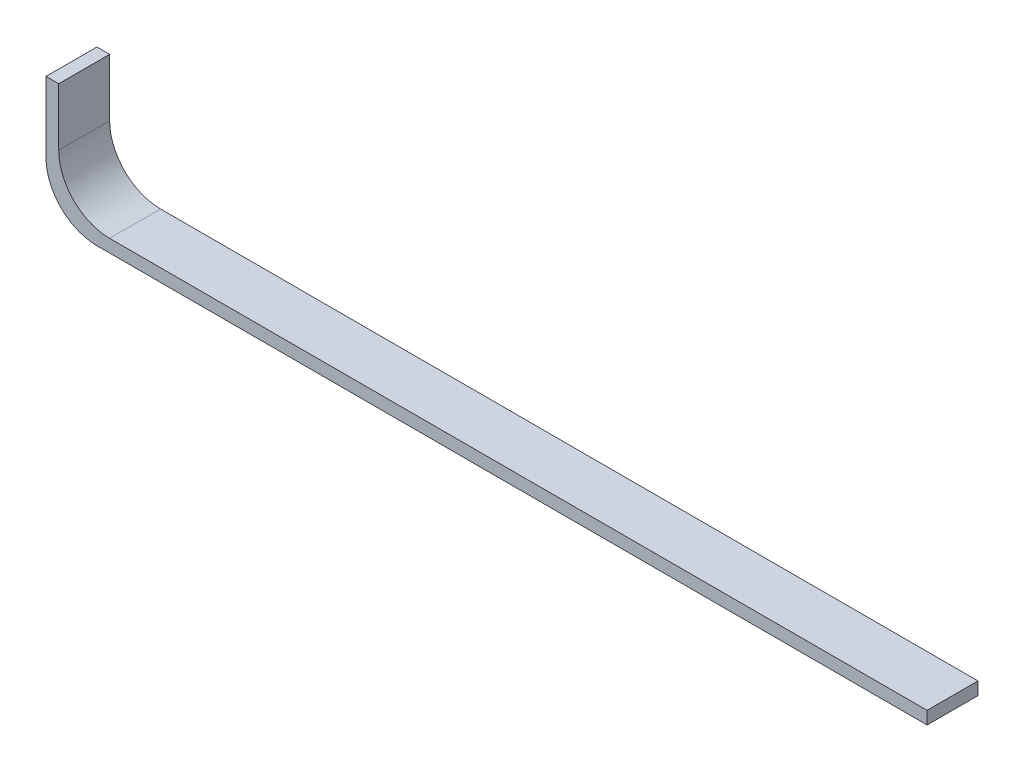
ISO-10303-21;
HEADER;
FILE_DESCRIPTION(('STEP AP214'),'2;1');
FILE_NAME('part.step','',(''),(''),'','','');
FILE_SCHEMA(('AUTOMOTIVE_DESIGN { 1 0 10303 214 1 1 1 1 }'));
ENDSEC;
DATA;
#1=APPLICATION_CONTEXT('core data for automotive mechanical design processes');
#2=APPLICATION_PROTOCOL_DEFINITION('international standard','automotive_design',2000,#1);
#3=PRODUCT_CONTEXT('',#1,'mechanical');
#4=PRODUCT('Part','Part','',(#3));
#5=PRODUCT_RELATED_PRODUCT_CATEGORY('part','',(#4));
#6=PRODUCT_DEFINITION_FORMATION('','',#4);
#7=PRODUCT_DEFINITION_CONTEXT('part definition',#1,'design');
#8=PRODUCT_DEFINITION('design','',#6,#7);
#9=PRODUCT_DEFINITION_SHAPE('','',#8);
#10=(LENGTH_UNIT() NAMED_UNIT(*) SI_UNIT(.MILLI.,.METRE.));
#11=(NAMED_UNIT(*) PLANE_ANGLE_UNIT() SI_UNIT($,.RADIAN.));
#12=(NAMED_UNIT(*) SI_UNIT($,.STERADIAN.) SOLID_ANGLE_UNIT());
#13=UNCERTAINTY_MEASURE_WITH_UNIT(LENGTH_MEASURE(1.E-05),#10,'distance_accuracy_value','');
#14=(GEOMETRIC_REPRESENTATION_CONTEXT(3) GLOBAL_UNCERTAINTY_ASSIGNED_CONTEXT((#13)) GLOBAL_UNIT_ASSIGNED_CONTEXT((#10,
#11,#12)) REPRESENTATION_CONTEXT('',''));
#15=CARTESIAN_POINT('',(0.,0.,0.));
#16=DIRECTION('',(0.,0.,1.));
#17=DIRECTION('',(1.,0.,0.));
#18=AXIS2_PLACEMENT_3D('',#15,#16,#17);
#19=CARTESIAN_POINT('',(0.,0.,2.54));
#20=DIRECTION('',(0.,-1.,0.));
#21=DIRECTION('',(0.,0.,-1.));
#22=AXIS2_PLACEMENT_3D('',#19,#20,#21);
#23=PLANE('',#22);
#24=DIRECTION('',(-1.,0.,0.));
#25=VECTOR('',#24,1.);
#26=CARTESIAN_POINT('',(0.,0.,0.));
#27=LINE('',#26,#25);
#28=CARTESIAN_POINT('',(0.635,0.,0.));
#29=VERTEX_POINT('',#28);
#30=CARTESIAN_POINT('',(0.,0.,0.));
#31=VERTEX_POINT('',#30);
#32=EDGE_CURVE('E130',#29,#31,#27,.T.);
#33=ORIENTED_EDGE('',*,*,#32,.T.);
#34=DIRECTION('',(0.,0.,-1.));
#35=VECTOR('',#34,1.);
#36=CARTESIAN_POINT('',(0.,0.,2.54));
#37=LINE('',#36,#35);
#38=CARTESIAN_POINT('',(0.,0.,2.54));
#39=VERTEX_POINT('',#38);
#40=EDGE_CURVE('E11',#39,#31,#37,.T.);
#41=ORIENTED_EDGE('',*,*,#40,.F.);
#42=DIRECTION('',(-1.,0.,0.));
#43=VECTOR('',#42,1.);
#44=CARTESIAN_POINT('',(0.,0.,2.54));
#45=LINE('',#44,#43);
#46=CARTESIAN_POINT('',(0.635,0.,2.54));
#47=VERTEX_POINT('',#46);
#48=EDGE_CURVE('E144',#47,#39,#45,.T.);
#49=ORIENTED_EDGE('',*,*,#48,.F.);
#50=DIRECTION('',(0.,0.,-1.));
#51=VECTOR('',#50,1.);
#52=CARTESIAN_POINT('',(0.635,0.,2.54));
#53=LINE('',#52,#51);
#54=EDGE_CURVE('E126',#47,#29,#53,.T.);
#55=ORIENTED_EDGE('',*,*,#54,.T.);
#56=EDGE_LOOP('',(#33,#41,#49,#55));
#57=FACE_BOUND('',#56,.T.);
#58=ADVANCED_FACE('F34',(#57),#23,.F.);
#59=CARTESIAN_POINT('',(0.,0.,2.54));
#60=DIRECTION('',(1.,0.,0.));
#61=DIRECTION('',(0.,0.,-1.));
#62=AXIS2_PLACEMENT_3D('',#59,#60,#61);
#63=PLANE('',#62);
#64=DIRECTION('',(0.,-1.,0.));
#65=VECTOR('',#64,1.);
#66=CARTESIAN_POINT('',(0.,0.,0.));
#67=LINE('',#66,#65);
#68=CARTESIAN_POINT('',(0.,-3.50696881978329,0.));
#69=VERTEX_POINT('',#68);
#70=EDGE_CURVE('E133',#31,#69,#67,.T.);
#71=ORIENTED_EDGE('',*,*,#70,.T.);
#72=DIRECTION('',(0.,0.,-1.));
#73=VECTOR('',#72,1.);
#74=CARTESIAN_POINT('',(0.,-3.50696881978329,2.54));
#75=LINE('',#74,#73);
#76=CARTESIAN_POINT('',(0.,-3.50696881978329,2.54));
#77=VERTEX_POINT('',#76);
#78=EDGE_CURVE('E42',#77,#69,#75,.T.);
#79=ORIENTED_EDGE('',*,*,#78,.F.);
#80=DIRECTION('',(0.,-1.,0.));
#81=VECTOR('',#80,1.);
#82=CARTESIAN_POINT('',(0.,0.,2.54));
#83=LINE('',#82,#81);
#84=EDGE_CURVE('E93',#39,#77,#83,.T.);
#85=ORIENTED_EDGE('',*,*,#84,.F.);
#86=ORIENTED_EDGE('',*,*,#40,.T.);
#87=EDGE_LOOP('',(#71,#79,#85,#86));
#88=FACE_BOUND('',#87,.T.);
#89=ADVANCED_FACE('F179',(#88),#63,.F.);
#90=CARTESIAN_POINT('',(2.54,-3.50696881978331,2.54));
#91=DIRECTION('',(0.,0.,-1.));
#92=DIRECTION('',(-1.,0.,0.));
#93=AXIS2_PLACEMENT_3D('',#90,#91,#92);
#94=CYLINDRICAL_SURFACE('',#93,2.54);
#95=CARTESIAN_POINT('',(2.54,-3.50696881978331,0.));
#96=DIRECTION('',(0.,0.,1.));
#97=DIRECTION('',(1.,0.,0.));
#98=AXIS2_PLACEMENT_3D('',#95,#96,#97);
#99=CIRCLE('',#98,2.54);
#100=CARTESIAN_POINT('',(2.54000000000002,-6.04696881978331,0.));
#101=VERTEX_POINT('',#100);
#102=EDGE_CURVE('E135',#69,#101,#99,.T.);
#103=ORIENTED_EDGE('',*,*,#102,.T.);
#104=DIRECTION('',(0.,0.,-1.));
#105=VECTOR('',#104,1.);
#106=CARTESIAN_POINT('',(2.54000000000002,-6.04696881978331,2.54));
#107=LINE('',#106,#105);
#108=CARTESIAN_POINT('',(2.54000000000002,-6.04696881978331,2.54));
#109=VERTEX_POINT('',#108);
#110=EDGE_CURVE('E151',#109,#101,#107,.T.);
#111=ORIENTED_EDGE('',*,*,#110,.F.);
#112=CARTESIAN_POINT('',(2.54,-3.50696881978331,2.54));
#113=DIRECTION('',(0.,0.,1.));
#114=DIRECTION('',(1.,0.,0.));
#115=AXIS2_PLACEMENT_3D('',#112,#113,#114);
#116=CIRCLE('',#115,2.54);
#117=EDGE_CURVE('E159',#77,#109,#116,.T.);
#118=ORIENTED_EDGE('',*,*,#117,.F.);
#119=ORIENTED_EDGE('',*,*,#78,.T.);
#120=EDGE_LOOP('',(#103,#111,#118,#119));
#121=FACE_BOUND('',#120,.T.);
#122=ADVANCED_FACE('F157',(#121),#94,.T.);
#123=CARTESIAN_POINT('',(2.54000000000002,-6.04696881978331,2.54));
#124=DIRECTION('',(0.,1.,0.));
#125=DIRECTION('',(0.,0.,1.));
#126=AXIS2_PLACEMENT_3D('',#123,#124,#125);
#127=PLANE('',#126);
#128=DIRECTION('',(1.,0.,0.));
#129=VECTOR('',#128,1.);
#130=CARTESIAN_POINT('',(2.54000000000002,-6.04696881978331,0.));
#131=LINE('',#130,#129);
#132=CARTESIAN_POINT('',(43.9665435516694,-6.04696881978331,0.));
#133=VERTEX_POINT('',#132);
#134=EDGE_CURVE('E137',#101,#133,#131,.T.);
#135=ORIENTED_EDGE('',*,*,#134,.T.);
#136=DIRECTION('',(0.,0.,-1.));
#137=VECTOR('',#136,1.);
#138=CARTESIAN_POINT('',(43.9665435516694,-6.04696881978331,2.54));
#139=LINE('',#138,#137);
#140=CARTESIAN_POINT('',(43.9665435516694,-6.04696881978331,2.54));
#141=VERTEX_POINT('',#140);
#142=EDGE_CURVE('E148',#141,#133,#139,.T.);
#143=ORIENTED_EDGE('',*,*,#142,.F.);
#144=DIRECTION('',(1.,0.,0.));
#145=VECTOR('',#144,1.);
#146=CARTESIAN_POINT('',(2.54000000000002,-6.04696881978331,2.54));
#147=LINE('',#146,#145);
#148=EDGE_CURVE('E171',#109,#141,#147,.T.);
#149=ORIENTED_EDGE('',*,*,#148,.F.);
#150=ORIENTED_EDGE('',*,*,#110,.T.);
#151=EDGE_LOOP('',(#135,#143,#149,#150));
#152=FACE_BOUND('',#151,.T.);
#153=ADVANCED_FACE('F167',(#152),#127,.F.);
#154=CARTESIAN_POINT('',(43.9665435516694,-5.41196881978331,2.54));
#155=DIRECTION('',(-1.,0.,0.));
#156=DIRECTION('',(0.,0.,1.));
#157=AXIS2_PLACEMENT_3D('',#154,#155,#156);
#158=PLANE('',#157);
#159=DIRECTION('',(0.,1.,0.));
#160=VECTOR('',#159,1.);
#161=CARTESIAN_POINT('',(43.9665435516694,-5.41196881978331,0.));
#162=LINE('',#161,#160);
#163=CARTESIAN_POINT('',(43.9665435516694,-5.41196881978331,0.));
#164=VERTEX_POINT('',#163);
#165=EDGE_CURVE('E139',#133,#164,#162,.T.);
#166=ORIENTED_EDGE('',*,*,#165,.T.);
#167=DIRECTION('',(0.,0.,-1.));
#168=VECTOR('',#167,1.);
#169=CARTESIAN_POINT('',(43.9665435516694,-5.41196881978331,2.54));
#170=LINE('',#169,#168);
#171=CARTESIAN_POINT('',(43.9665435516694,-5.41196881978331,2.54));
#172=VERTEX_POINT('',#171);
#173=EDGE_CURVE('E121',#172,#164,#170,.T.);
#174=ORIENTED_EDGE('',*,*,#173,.F.);
#175=DIRECTION('',(0.,1.,0.));
#176=VECTOR('',#175,1.);
#177=CARTESIAN_POINT('',(43.9665435516694,-5.41196881978331,2.54));
#178=LINE('',#177,#176);
#179=EDGE_CURVE('E112',#141,#172,#178,.T.);
#180=ORIENTED_EDGE('',*,*,#179,.F.);
#181=ORIENTED_EDGE('',*,*,#142,.T.);
#182=EDGE_LOOP('',(#166,#174,#180,#181));
#183=FACE_BOUND('',#182,.T.);
#184=ADVANCED_FACE('F170',(#183),#158,.F.);
#185=CARTESIAN_POINT('',(3.17500000000002,-5.41196881978331,2.54));
#186=DIRECTION('',(0.,-1.,0.));
#187=DIRECTION('',(0.,0.,-1.));
#188=AXIS2_PLACEMENT_3D('',#185,#186,#187);
#189=PLANE('',#188);
#190=DIRECTION('',(-1.,0.,0.));
#191=VECTOR('',#190,1.);
#192=CARTESIAN_POINT('',(3.17500000000002,-5.41196881978331,0.));
#193=LINE('',#192,#191);
#194=CARTESIAN_POINT('',(3.17500000000002,-5.41196881978331,0.));
#195=VERTEX_POINT('',#194);
#196=EDGE_CURVE('E120',#164,#195,#193,.T.);
#197=ORIENTED_EDGE('',*,*,#196,.T.);
#198=DIRECTION('',(0.,0.,-1.));
#199=VECTOR('',#198,1.);
#200=CARTESIAN_POINT('',(3.17500000000002,-5.41196881978331,2.54));
#201=LINE('',#200,#199);
#202=CARTESIAN_POINT('',(3.17500000000002,-5.41196881978331,2.54));
#203=VERTEX_POINT('',#202);
#204=EDGE_CURVE('E117',#203,#195,#201,.T.);
#205=ORIENTED_EDGE('',*,*,#204,.F.);
#206=DIRECTION('',(-1.,0.,0.));
#207=VECTOR('',#206,1.);
#208=CARTESIAN_POINT('',(3.17500000000002,-5.41196881978331,2.54));
#209=LINE('',#208,#207);
#210=EDGE_CURVE('E106',#172,#203,#209,.T.);
#211=ORIENTED_EDGE('',*,*,#210,.F.);
#212=ORIENTED_EDGE('',*,*,#173,.T.);
#213=EDGE_LOOP('',(#197,#205,#211,#212));
#214=FACE_BOUND('',#213,.T.);
#215=ADVANCED_FACE('F118',(#214),#189,.F.);
#216=CARTESIAN_POINT('',(3.175,-2.87196881978331,2.54));
#217=DIRECTION('',(0.,0.,-1.));
#218=DIRECTION('',(-1.,0.,0.));
#219=AXIS2_PLACEMENT_3D('',#216,#217,#218);
#220=CYLINDRICAL_SURFACE('',#219,2.54);
#221=CARTESIAN_POINT('',(3.175,-2.87196881978331,0.));
#222=DIRECTION('',(0.,0.,-1.));
#223=DIRECTION('',(1.,0.,0.));
#224=AXIS2_PLACEMENT_3D('',#221,#222,#223);
#225=CIRCLE('',#224,2.54);
#226=CARTESIAN_POINT('',(0.635000000000001,-2.87196881978329,0.));
#227=VERTEX_POINT('',#226);
#228=EDGE_CURVE('E79',#195,#227,#225,.T.);
#229=ORIENTED_EDGE('',*,*,#228,.T.);
#230=DIRECTION('',(0.,0.,-1.));
#231=VECTOR('',#230,1.);
#232=CARTESIAN_POINT('',(0.635000000000001,-2.87196881978329,2.54));
#233=LINE('',#232,#231);
#234=CARTESIAN_POINT('',(0.635000000000001,-2.87196881978329,2.54));
#235=VERTEX_POINT('',#234);
#236=EDGE_CURVE('E122',#235,#227,#233,.T.);
#237=ORIENTED_EDGE('',*,*,#236,.F.);
#238=CARTESIAN_POINT('',(3.175,-2.87196881978331,2.54));
#239=DIRECTION('',(0.,0.,-1.));
#240=DIRECTION('',(1.,0.,0.));
#241=AXIS2_PLACEMENT_3D('',#238,#239,#240);
#242=CIRCLE('',#241,2.54);
#243=EDGE_CURVE('E110',#203,#235,#242,.T.);
#244=ORIENTED_EDGE('',*,*,#243,.F.);
#245=ORIENTED_EDGE('',*,*,#204,.T.);
#246=EDGE_LOOP('',(#229,#237,#244,#245));
#247=FACE_BOUND('',#246,.T.);
#248=ADVANCED_FACE('F124',(#247),#220,.F.);
#249=CARTESIAN_POINT('',(0.635,0.,2.54));
#250=DIRECTION('',(-1.,0.,0.));
#251=DIRECTION('',(0.,-1.,0.));
#252=AXIS2_PLACEMENT_3D('',#249,#250,#251);
#253=PLANE('',#252);
#254=DIRECTION('',(0.,1.,0.));
#255=VECTOR('',#254,1.);
#256=CARTESIAN_POINT('',(0.635,0.,0.));
#257=LINE('',#256,#255);
#258=EDGE_CURVE('E85',#227,#29,#257,.T.);
#259=ORIENTED_EDGE('',*,*,#258,.T.);
#260=ORIENTED_EDGE('',*,*,#54,.F.);
#261=DIRECTION('',(0.,1.,0.));
#262=VECTOR('',#261,1.);
#263=CARTESIAN_POINT('',(0.635,0.,2.54));
#264=LINE('',#263,#262);
#265=EDGE_CURVE('E50',#235,#47,#264,.T.);
#266=ORIENTED_EDGE('',*,*,#265,.F.);
#267=ORIENTED_EDGE('',*,*,#236,.T.);
#268=EDGE_LOOP('',(#259,#260,#266,#267));
#269=FACE_BOUND('',#268,.T.);
#270=ADVANCED_FACE('F195',(#269),#253,.F.);
#271=CARTESIAN_POINT('',(3.175,-2.87196881978331,2.54));
#272=DIRECTION('',(0.,0.,1.));
#273=DIRECTION('',(1.,0.,0.));
#274=AXIS2_PLACEMENT_3D('',#271,#272,#273);
#275=PLANE('',#274);
#276=ORIENTED_EDGE('',*,*,#48,.T.);
#277=ORIENTED_EDGE('',*,*,#84,.T.);
#278=ORIENTED_EDGE('',*,*,#117,.T.);
#279=ORIENTED_EDGE('',*,*,#148,.T.);
#280=ORIENTED_EDGE('',*,*,#179,.T.);
#281=ORIENTED_EDGE('',*,*,#210,.T.);
#282=ORIENTED_EDGE('',*,*,#243,.T.);
#283=ORIENTED_EDGE('',*,*,#265,.T.);
#284=EDGE_LOOP('',(#276,#277,#278,#279,#280,#281,#282,#283));
#285=FACE_BOUND('',#284,.T.);
#286=ADVANCED_FACE('F108',(#285),#275,.T.);
#287=CARTESIAN_POINT('',(3.175,-2.87196881978331,0.));
#288=DIRECTION('',(0.,0.,1.));
#289=DIRECTION('',(1.,0.,0.));
#290=AXIS2_PLACEMENT_3D('',#287,#288,#289);
#291=PLANE('',#290);
#292=ORIENTED_EDGE('',*,*,#32,.F.);
#293=ORIENTED_EDGE('',*,*,#258,.F.);
#294=ORIENTED_EDGE('',*,*,#228,.F.);
#295=ORIENTED_EDGE('',*,*,#196,.F.);
#296=ORIENTED_EDGE('',*,*,#165,.F.);
#297=ORIENTED_EDGE('',*,*,#134,.F.);
#298=ORIENTED_EDGE('',*,*,#102,.F.);
#299=ORIENTED_EDGE('',*,*,#70,.F.);
#300=EDGE_LOOP('',(#292,#293,#294,#295,#296,#297,#298,#299));
#301=FACE_BOUND('',#300,.T.);
#302=ADVANCED_FACE('F163',(#301),#291,.F.);
#303=CLOSED_SHELL('',(#58,#89,#122,#153,#184,#215,#248,#270,#286,#302));
#304=MANIFOLD_SOLID_BREP('B2',#303);
#305=ADVANCED_BREP_SHAPE_REPRESENTATION('',(#18,#304),#14);
#306=SHAPE_DEFINITION_REPRESENTATION(#9,#305);
ENDSEC;
END-ISO-10303-21;
